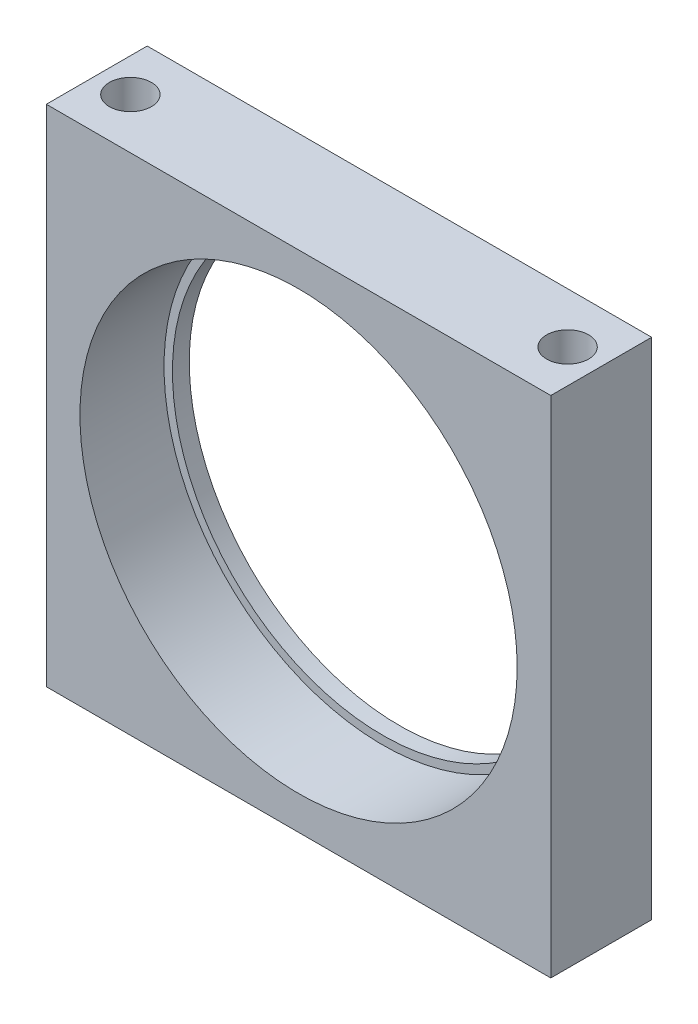
ISO-10303-21;
HEADER;
FILE_DESCRIPTION(('STEP AP214'),'2;1');
FILE_NAME('part.step','',(''),(''),'','','');
FILE_SCHEMA(('AUTOMOTIVE_DESIGN { 1 0 10303 214 1 1 1 1 }'));
ENDSEC;
DATA;
#1=APPLICATION_CONTEXT('core data for automotive mechanical design processes');
#2=APPLICATION_PROTOCOL_DEFINITION('international standard','automotive_design',2000,#1);
#3=PRODUCT_CONTEXT('',#1,'mechanical');
#4=PRODUCT('Part','Part','',(#3));
#5=PRODUCT_RELATED_PRODUCT_CATEGORY('part','',(#4));
#6=PRODUCT_DEFINITION_FORMATION('','',#4);
#7=PRODUCT_DEFINITION_CONTEXT('part definition',#1,'design');
#8=PRODUCT_DEFINITION('design','',#6,#7);
#9=PRODUCT_DEFINITION_SHAPE('','',#8);
#10=(LENGTH_UNIT() NAMED_UNIT(*) SI_UNIT(.MILLI.,.METRE.));
#11=(NAMED_UNIT(*) PLANE_ANGLE_UNIT() SI_UNIT($,.RADIAN.));
#12=(NAMED_UNIT(*) SI_UNIT($,.STERADIAN.) SOLID_ANGLE_UNIT());
#13=UNCERTAINTY_MEASURE_WITH_UNIT(LENGTH_MEASURE(1.E-05),#10,'distance_accuracy_value','');
#14=(GEOMETRIC_REPRESENTATION_CONTEXT(3) GLOBAL_UNCERTAINTY_ASSIGNED_CONTEXT((#13)) GLOBAL_UNIT_ASSIGNED_CONTEXT((#10,
#11,#12)) REPRESENTATION_CONTEXT('',''));
#15=CARTESIAN_POINT('',(0.,0.,0.));
#16=DIRECTION('',(0.,0.,1.));
#17=DIRECTION('',(1.,0.,0.));
#18=AXIS2_PLACEMENT_3D('',#15,#16,#17);
#19=CARTESIAN_POINT('',(0.,0.,6.));
#20=DIRECTION('',(0.,1.,0.));
#21=DIRECTION('',(0.,0.,1.));
#22=AXIS2_PLACEMENT_3D('',#19,#20,#21);
#23=PLANE('',#22);
#24=CARTESIAN_POINT('',(2.,0.,3.));
#25=DIRECTION('',(0.,-1.,0.));
#26=DIRECTION('',(0.,0.,-1.));
#27=AXIS2_PLACEMENT_3D('',#24,#25,#26);
#28=CIRCLE('',#27,1.24999999999999);
#29=CARTESIAN_POINT('',(2.,0.,1.75000000000001));
#30=VERTEX_POINT('',#29);
#31=EDGE_CURVE('E106',#30,#30,#28,.T.);
#32=ORIENTED_EDGE('',*,*,#31,.F.);
#33=EDGE_LOOP('',(#32));
#34=FACE_BOUND('',#33,.T.);
#35=DIRECTION('',(1.,0.,0.));
#36=VECTOR('',#35,1.);
#37=CARTESIAN_POINT('',(0.,0.,0.));
#38=LINE('',#37,#36);
#39=CARTESIAN_POINT('',(0.,0.,0.));
#40=VERTEX_POINT('',#39);
#41=CARTESIAN_POINT('',(30.,0.,0.));
#42=VERTEX_POINT('',#41);
#43=EDGE_CURVE('E147',#40,#42,#38,.T.);
#44=ORIENTED_EDGE('',*,*,#43,.T.);
#45=DIRECTION('',(0.,0.,-1.));
#46=VECTOR('',#45,1.);
#47=CARTESIAN_POINT('',(30.,0.,6.));
#48=LINE('',#47,#46);
#49=CARTESIAN_POINT('',(30.,0.,6.));
#50=VERTEX_POINT('',#49);
#51=EDGE_CURVE('E43',#50,#42,#48,.T.);
#52=ORIENTED_EDGE('',*,*,#51,.F.);
#53=DIRECTION('',(1.,0.,0.));
#54=VECTOR('',#53,1.);
#55=CARTESIAN_POINT('',(0.,0.,6.));
#56=LINE('',#55,#54);
#57=CARTESIAN_POINT('',(0.,0.,6.));
#58=VERTEX_POINT('',#57);
#59=EDGE_CURVE('E82',#58,#50,#56,.T.);
#60=ORIENTED_EDGE('',*,*,#59,.F.);
#61=DIRECTION('',(0.,0.,-1.));
#62=VECTOR('',#61,1.);
#63=CARTESIAN_POINT('',(0.,0.,6.));
#64=LINE('',#63,#62);
#65=EDGE_CURVE('E11',#58,#40,#64,.T.);
#66=ORIENTED_EDGE('',*,*,#65,.T.);
#67=EDGE_LOOP('',(#44,#52,#60,#66));
#68=FACE_BOUND('',#67,.T.);
#69=CARTESIAN_POINT('',(28.,0.,3.));
#70=DIRECTION('',(0.,-1.,0.));
#71=DIRECTION('',(0.,0.,-1.));
#72=AXIS2_PLACEMENT_3D('',#69,#70,#71);
#73=CIRCLE('',#72,1.24999999999999);
#74=CARTESIAN_POINT('',(28.,0.,1.75000000000001));
#75=VERTEX_POINT('',#74);
#76=EDGE_CURVE('E105',#75,#75,#73,.T.);
#77=ORIENTED_EDGE('',*,*,#76,.F.);
#78=EDGE_LOOP('',(#77));
#79=FACE_BOUND('',#78,.T.);
#80=ADVANCED_FACE('F33',(#34,#68,#79),#23,.F.);
#81=CARTESIAN_POINT('',(15.,15.,6.));
#82=DIRECTION('',(0.,0.,-1.));
#83=DIRECTION('',(-1.,0.,0.));
#84=AXIS2_PLACEMENT_3D('',#81,#82,#83);
#85=CYLINDRICAL_SURFACE('',#84,12.5);
#86=CARTESIAN_POINT('',(15.,15.,0.));
#87=DIRECTION('',(0.,0.,1.));
#88=DIRECTION('',(1.,0.,0.));
#89=AXIS2_PLACEMENT_3D('',#86,#87,#88);
#90=CIRCLE('',#89,12.5);
#91=CARTESIAN_POINT('',(27.5,15.,0.));
#92=VERTEX_POINT('',#91);
#93=EDGE_CURVE('E134',#92,#92,#90,.T.);
#94=ORIENTED_EDGE('',*,*,#93,.F.);
#95=EDGE_LOOP('',(#94));
#96=FACE_BOUND('',#95,.T.);
#97=CARTESIAN_POINT('',(15.,15.,1.));
#98=DIRECTION('',(0.,0.,1.));
#99=DIRECTION('',(1.,0.,0.));
#100=AXIS2_PLACEMENT_3D('',#97,#98,#99);
#101=CIRCLE('',#100,12.5);
#102=CARTESIAN_POINT('',(27.5,15.,1.));
#103=VERTEX_POINT('',#102);
#104=EDGE_CURVE('E37',#103,#103,#101,.T.);
#105=ORIENTED_EDGE('',*,*,#104,.T.);
#106=EDGE_LOOP('',(#105));
#107=FACE_BOUND('',#106,.T.);
#108=ADVANCED_FACE('F180',(#96,#107),#85,.F.);
#109=CARTESIAN_POINT('',(0.,0.,6.));
#110=DIRECTION('',(0.,0.,-1.));
#111=DIRECTION('',(-1.,0.,0.));
#112=AXIS2_PLACEMENT_3D('',#109,#110,#111);
#113=PLANE('',#112);
#114=CARTESIAN_POINT('',(15.,15.,6.));
#115=DIRECTION('',(0.,0.,1.));
#116=DIRECTION('',(1.,0.,0.));
#117=AXIS2_PLACEMENT_3D('',#114,#115,#116);
#118=CIRCLE('',#117,13.);
#119=CARTESIAN_POINT('',(28.,15.,6.));
#120=VERTEX_POINT('',#119);
#121=EDGE_CURVE('E128',#120,#120,#118,.T.);
#122=ORIENTED_EDGE('',*,*,#121,.F.);
#123=EDGE_LOOP('',(#122));
#124=FACE_BOUND('',#123,.T.);
#125=DIRECTION('',(0.,-1.,0.));
#126=VECTOR('',#125,1.);
#127=CARTESIAN_POINT('',(0.,0.,6.));
#128=LINE('',#127,#126);
#129=CARTESIAN_POINT('',(0.,30.,6.));
#130=VERTEX_POINT('',#129);
#131=EDGE_CURVE('E138',#130,#58,#128,.T.);
#132=ORIENTED_EDGE('',*,*,#131,.T.);
#133=ORIENTED_EDGE('',*,*,#59,.T.);
#134=DIRECTION('',(0.,1.,0.));
#135=VECTOR('',#134,1.);
#136=CARTESIAN_POINT('',(30.,0.,6.));
#137=LINE('',#136,#135);
#138=CARTESIAN_POINT('',(30.,30.,6.));
#139=VERTEX_POINT('',#138);
#140=EDGE_CURVE('E141',#50,#139,#137,.T.);
#141=ORIENTED_EDGE('',*,*,#140,.T.);
#142=DIRECTION('',(-1.,0.,0.));
#143=VECTOR('',#142,1.);
#144=CARTESIAN_POINT('',(0.,30.,6.));
#145=LINE('',#144,#143);
#146=EDGE_CURVE('E51',#139,#130,#145,.T.);
#147=ORIENTED_EDGE('',*,*,#146,.T.);
#148=EDGE_LOOP('',(#132,#133,#141,#147));
#149=FACE_BOUND('',#148,.T.);
#150=ADVANCED_FACE('F185',(#124,#149),#113,.F.);
#151=CARTESIAN_POINT('',(0.,0.,0.));
#152=DIRECTION('',(0.,0.,-1.));
#153=DIRECTION('',(-1.,0.,0.));
#154=AXIS2_PLACEMENT_3D('',#151,#152,#153);
#155=PLANE('',#154);
#156=DIRECTION('',(0.,-1.,0.));
#157=VECTOR('',#156,1.);
#158=CARTESIAN_POINT('',(0.,0.,0.));
#159=LINE('',#158,#157);
#160=CARTESIAN_POINT('',(0.,30.,0.));
#161=VERTEX_POINT('',#160);
#162=EDGE_CURVE('E137',#161,#40,#159,.T.);
#163=ORIENTED_EDGE('',*,*,#162,.F.);
#164=DIRECTION('',(-1.,0.,0.));
#165=VECTOR('',#164,1.);
#166=CARTESIAN_POINT('',(0.,30.,0.));
#167=LINE('',#166,#165);
#168=CARTESIAN_POINT('',(30.,30.,0.));
#169=VERTEX_POINT('',#168);
#170=EDGE_CURVE('E75',#169,#161,#167,.T.);
#171=ORIENTED_EDGE('',*,*,#170,.F.);
#172=DIRECTION('',(0.,1.,0.));
#173=VECTOR('',#172,1.);
#174=CARTESIAN_POINT('',(30.,0.,0.));
#175=LINE('',#174,#173);
#176=EDGE_CURVE('E69',#42,#169,#175,.T.);
#177=ORIENTED_EDGE('',*,*,#176,.F.);
#178=ORIENTED_EDGE('',*,*,#43,.F.);
#179=EDGE_LOOP('',(#163,#171,#177,#178));
#180=FACE_BOUND('',#179,.T.);
#181=ORIENTED_EDGE('',*,*,#93,.T.);
#182=EDGE_LOOP('',(#181));
#183=FACE_BOUND('',#182,.T.);
#184=ADVANCED_FACE('F158',(#180,#183),#155,.T.);
#185=CARTESIAN_POINT('',(0.,0.,6.));
#186=DIRECTION('',(1.,0.,0.));
#187=DIRECTION('',(0.,0.,-1.));
#188=AXIS2_PLACEMENT_3D('',#185,#186,#187);
#189=PLANE('',#188);
#190=ORIENTED_EDGE('',*,*,#162,.T.);
#191=ORIENTED_EDGE('',*,*,#65,.F.);
#192=ORIENTED_EDGE('',*,*,#131,.F.);
#193=DIRECTION('',(0.,0.,-1.));
#194=VECTOR('',#193,1.);
#195=CARTESIAN_POINT('',(0.,30.,6.));
#196=LINE('',#195,#194);
#197=EDGE_CURVE('E144',#130,#161,#196,.T.);
#198=ORIENTED_EDGE('',*,*,#197,.T.);
#199=EDGE_LOOP('',(#190,#191,#192,#198));
#200=FACE_BOUND('',#199,.T.);
#201=ADVANCED_FACE('F35',(#200),#189,.F.);
#202=CARTESIAN_POINT('',(30.,0.,6.));
#203=DIRECTION('',(-1.,0.,0.));
#204=DIRECTION('',(0.,0.,1.));
#205=AXIS2_PLACEMENT_3D('',#202,#203,#204);
#206=PLANE('',#205);
#207=ORIENTED_EDGE('',*,*,#176,.T.);
#208=DIRECTION('',(0.,0.,-1.));
#209=VECTOR('',#208,1.);
#210=CARTESIAN_POINT('',(30.,30.,6.));
#211=LINE('',#210,#209);
#212=EDGE_CURVE('E152',#139,#169,#211,.T.);
#213=ORIENTED_EDGE('',*,*,#212,.F.);
#214=ORIENTED_EDGE('',*,*,#140,.F.);
#215=ORIENTED_EDGE('',*,*,#51,.T.);
#216=EDGE_LOOP('',(#207,#213,#214,#215));
#217=FACE_BOUND('',#216,.T.);
#218=ADVANCED_FACE('F155',(#217),#206,.F.);
#219=CARTESIAN_POINT('',(0.,30.,6.));
#220=DIRECTION('',(0.,-1.,0.));
#221=DIRECTION('',(0.,0.,-1.));
#222=AXIS2_PLACEMENT_3D('',#219,#220,#221);
#223=PLANE('',#222);
#224=CARTESIAN_POINT('',(2.,30.,3.));
#225=DIRECTION('',(0.,1.,0.));
#226=DIRECTION('',(0.,0.,1.));
#227=AXIS2_PLACEMENT_3D('',#224,#225,#226);
#228=CIRCLE('',#227,1.24999999999999);
#229=CARTESIAN_POINT('',(2.,30.,4.24999999999999));
#230=VERTEX_POINT('',#229);
#231=EDGE_CURVE('E116',#230,#230,#228,.T.);
#232=ORIENTED_EDGE('',*,*,#231,.F.);
#233=EDGE_LOOP('',(#232));
#234=FACE_BOUND('',#233,.T.);
#235=CARTESIAN_POINT('',(28.,30.,3.));
#236=DIRECTION('',(0.,1.,0.));
#237=DIRECTION('',(0.,0.,1.));
#238=AXIS2_PLACEMENT_3D('',#235,#236,#237);
#239=CIRCLE('',#238,1.24999999999999);
#240=CARTESIAN_POINT('',(28.,30.,4.24999999999999));
#241=VERTEX_POINT('',#240);
#242=EDGE_CURVE('E122',#241,#241,#239,.T.);
#243=ORIENTED_EDGE('',*,*,#242,.F.);
#244=EDGE_LOOP('',(#243));
#245=FACE_BOUND('',#244,.T.);
#246=ORIENTED_EDGE('',*,*,#170,.T.);
#247=ORIENTED_EDGE('',*,*,#197,.F.);
#248=ORIENTED_EDGE('',*,*,#146,.F.);
#249=ORIENTED_EDGE('',*,*,#212,.T.);
#250=EDGE_LOOP('',(#246,#247,#248,#249));
#251=FACE_BOUND('',#250,.T.);
#252=ADVANCED_FACE('F163',(#234,#245,#251),#223,.F.);
#253=CARTESIAN_POINT('',(15.,15.,1.));
#254=DIRECTION('',(0.,0.,1.));
#255=DIRECTION('',(1.,0.,0.));
#256=AXIS2_PLACEMENT_3D('',#253,#254,#255);
#257=CYLINDRICAL_SURFACE('',#256,13.);
#258=CARTESIAN_POINT('',(15.,15.,1.));
#259=DIRECTION('',(0.,0.,1.));
#260=DIRECTION('',(1.,0.,0.));
#261=AXIS2_PLACEMENT_3D('',#258,#259,#260);
#262=CIRCLE('',#261,13.);
#263=CARTESIAN_POINT('',(28.,15.,1.));
#264=VERTEX_POINT('',#263);
#265=EDGE_CURVE('E129',#264,#264,#262,.T.);
#266=ORIENTED_EDGE('',*,*,#265,.F.);
#267=EDGE_LOOP('',(#266));
#268=FACE_BOUND('',#267,.T.);
#269=ORIENTED_EDGE('',*,*,#121,.T.);
#270=EDGE_LOOP('',(#269));
#271=FACE_BOUND('',#270,.T.);
#272=ADVANCED_FACE('F165',(#268,#271),#257,.F.);
#273=CARTESIAN_POINT('',(15.,15.,1.));
#274=DIRECTION('',(0.,0.,1.));
#275=DIRECTION('',(1.,0.,0.));
#276=AXIS2_PLACEMENT_3D('',#273,#274,#275);
#277=PLANE('',#276);
#278=ORIENTED_EDGE('',*,*,#104,.F.);
#279=EDGE_LOOP('',(#278));
#280=FACE_BOUND('',#279,.T.);
#281=ORIENTED_EDGE('',*,*,#265,.T.);
#282=EDGE_LOOP('',(#281));
#283=FACE_BOUND('',#282,.T.);
#284=ADVANCED_FACE('F172',(#280,#283),#277,.T.);
#285=CARTESIAN_POINT('',(28.,24.,3.));
#286=DIRECTION('',(0.,1.,0.));
#287=DIRECTION('',(0.,0.,1.));
#288=AXIS2_PLACEMENT_3D('',#285,#286,#287);
#289=CONICAL_SURFACE('',#288,1.24999999999999,1.02974425867665);
#290=CARTESIAN_POINT('',(28.,23.2489242262155,3.));
#291=VERTEX_POINT('',#290);
#292=VERTEX_LOOP('',#291);
#293=FACE_BOUND('',#292,.T.);
#294=CARTESIAN_POINT('',(28.,24.,3.));
#295=DIRECTION('',(0.,1.,0.));
#296=DIRECTION('',(0.,0.,1.));
#297=AXIS2_PLACEMENT_3D('',#294,#295,#296);
#298=CIRCLE('',#297,1.24999999999999);
#299=CARTESIAN_POINT('',(28.,24.,4.24999999999999));
#300=VERTEX_POINT('',#299);
#301=EDGE_CURVE('E125',#300,#300,#298,.T.);
#302=ORIENTED_EDGE('',*,*,#301,.T.);
#303=EDGE_LOOP('',(#302));
#304=FACE_BOUND('',#303,.T.);
#305=ADVANCED_FACE('F215',(#293,#304),#289,.F.);
#306=CARTESIAN_POINT('',(28.,30.,3.));
#307=DIRECTION('',(0.,1.,0.));
#308=DIRECTION('',(0.,0.,1.));
#309=AXIS2_PLACEMENT_3D('',#306,#307,#308);
#310=CYLINDRICAL_SURFACE('',#309,1.24999999999999);
#311=ORIENTED_EDGE('',*,*,#301,.F.);
#312=EDGE_LOOP('',(#311));
#313=FACE_BOUND('',#312,.T.);
#314=ORIENTED_EDGE('',*,*,#242,.T.);
#315=EDGE_LOOP('',(#314));
#316=FACE_BOUND('',#315,.T.);
#317=ADVANCED_FACE('F211',(#313,#316),#310,.F.);
#318=CARTESIAN_POINT('',(2.,24.,3.));
#319=DIRECTION('',(0.,1.,0.));
#320=DIRECTION('',(0.,0.,1.));
#321=AXIS2_PLACEMENT_3D('',#318,#319,#320);
#322=CONICAL_SURFACE('',#321,1.24999999999999,1.02974425867665);
#323=CARTESIAN_POINT('',(2.,23.2489242262155,3.));
#324=VERTEX_POINT('',#323);
#325=VERTEX_LOOP('',#324);
#326=FACE_BOUND('',#325,.T.);
#327=CARTESIAN_POINT('',(2.,24.,3.));
#328=DIRECTION('',(0.,1.,0.));
#329=DIRECTION('',(0.,0.,1.));
#330=AXIS2_PLACEMENT_3D('',#327,#328,#329);
#331=CIRCLE('',#330,1.24999999999999);
#332=CARTESIAN_POINT('',(2.,24.,4.24999999999999));
#333=VERTEX_POINT('',#332);
#334=EDGE_CURVE('E119',#333,#333,#331,.T.);
#335=ORIENTED_EDGE('',*,*,#334,.T.);
#336=EDGE_LOOP('',(#335));
#337=FACE_BOUND('',#336,.T.);
#338=ADVANCED_FACE('F207',(#326,#337),#322,.F.);
#339=CARTESIAN_POINT('',(2.,30.,3.));
#340=DIRECTION('',(0.,1.,0.));
#341=DIRECTION('',(0.,0.,1.));
#342=AXIS2_PLACEMENT_3D('',#339,#340,#341);
#343=CYLINDRICAL_SURFACE('',#342,1.24999999999999);
#344=ORIENTED_EDGE('',*,*,#334,.F.);
#345=EDGE_LOOP('',(#344));
#346=FACE_BOUND('',#345,.T.);
#347=ORIENTED_EDGE('',*,*,#231,.T.);
#348=EDGE_LOOP('',(#347));
#349=FACE_BOUND('',#348,.T.);
#350=ADVANCED_FACE('F199',(#346,#349),#343,.F.);
#351=CARTESIAN_POINT('',(28.,6.00000000000001,3.));
#352=DIRECTION('',(0.,-1.,0.));
#353=DIRECTION('',(0.,0.,-1.));
#354=AXIS2_PLACEMENT_3D('',#351,#352,#353);
#355=CONICAL_SURFACE('',#354,1.24999999999999,1.02974425867665);
#356=CARTESIAN_POINT('',(28.,6.75107577378445,3.));
#357=VERTEX_POINT('',#356);
#358=VERTEX_LOOP('',#357);
#359=FACE_BOUND('',#358,.T.);
#360=CARTESIAN_POINT('',(28.,6.00000000000001,3.));
#361=DIRECTION('',(0.,-1.,0.));
#362=DIRECTION('',(0.,0.,-1.));
#363=AXIS2_PLACEMENT_3D('',#360,#361,#362);
#364=CIRCLE('',#363,1.24999999999999);
#365=CARTESIAN_POINT('',(28.,6.00000000000001,1.75000000000001));
#366=VERTEX_POINT('',#365);
#367=EDGE_CURVE('E109',#366,#366,#364,.T.);
#368=ORIENTED_EDGE('',*,*,#367,.T.);
#369=EDGE_LOOP('',(#368));
#370=FACE_BOUND('',#369,.T.);
#371=ADVANCED_FACE('F193',(#359,#370),#355,.F.);
#372=CARTESIAN_POINT('',(28.,0.,3.));
#373=DIRECTION('',(0.,-1.,0.));
#374=DIRECTION('',(0.,0.,-1.));
#375=AXIS2_PLACEMENT_3D('',#372,#373,#374);
#376=CYLINDRICAL_SURFACE('',#375,1.24999999999999);
#377=ORIENTED_EDGE('',*,*,#367,.F.);
#378=EDGE_LOOP('',(#377));
#379=FACE_BOUND('',#378,.T.);
#380=ORIENTED_EDGE('',*,*,#76,.T.);
#381=EDGE_LOOP('',(#380));
#382=FACE_BOUND('',#381,.T.);
#383=ADVANCED_FACE('F99',(#379,#382),#376,.F.);
#384=CARTESIAN_POINT('',(2.,6.00000000000001,3.));
#385=DIRECTION('',(0.,-1.,0.));
#386=DIRECTION('',(0.,0.,-1.));
#387=AXIS2_PLACEMENT_3D('',#384,#385,#386);
#388=CONICAL_SURFACE('',#387,1.24999999999999,1.02974425867665);
#389=CARTESIAN_POINT('',(2.,6.75107577378445,3.));
#390=VERTEX_POINT('',#389);
#391=VERTEX_LOOP('',#390);
#392=FACE_BOUND('',#391,.T.);
#393=CARTESIAN_POINT('',(2.,6.00000000000001,3.));
#394=DIRECTION('',(0.,-1.,0.));
#395=DIRECTION('',(0.,0.,-1.));
#396=AXIS2_PLACEMENT_3D('',#393,#394,#395);
#397=CIRCLE('',#396,1.24999999999999);
#398=CARTESIAN_POINT('',(2.,6.00000000000001,1.75000000000001));
#399=VERTEX_POINT('',#398);
#400=EDGE_CURVE('E103',#399,#399,#397,.T.);
#401=ORIENTED_EDGE('',*,*,#400,.T.);
#402=EDGE_LOOP('',(#401));
#403=FACE_BOUND('',#402,.T.);
#404=ADVANCED_FACE('F95',(#392,#403),#388,.F.);
#405=CARTESIAN_POINT('',(2.,0.,3.));
#406=DIRECTION('',(0.,-1.,0.));
#407=DIRECTION('',(0.,0.,-1.));
#408=AXIS2_PLACEMENT_3D('',#405,#406,#407);
#409=CYLINDRICAL_SURFACE('',#408,1.24999999999999);
#410=ORIENTED_EDGE('',*,*,#400,.F.);
#411=EDGE_LOOP('',(#410));
#412=FACE_BOUND('',#411,.T.);
#413=ORIENTED_EDGE('',*,*,#31,.T.);
#414=EDGE_LOOP('',(#413));
#415=FACE_BOUND('',#414,.T.);
#416=ADVANCED_FACE('F98',(#412,#415),#409,.F.);
#417=CLOSED_SHELL('',(#80,#108,#150,#184,#201,#218,#252,#272,#284,#305,#317,#338,#350,#371,#383,
#404,#416));
#418=MANIFOLD_SOLID_BREP('B2',#417);
#419=ADVANCED_BREP_SHAPE_REPRESENTATION('',(#18,#418),#14);
#420=SHAPE_DEFINITION_REPRESENTATION(#9,#419);
ENDSEC;
END-ISO-10303-21;
